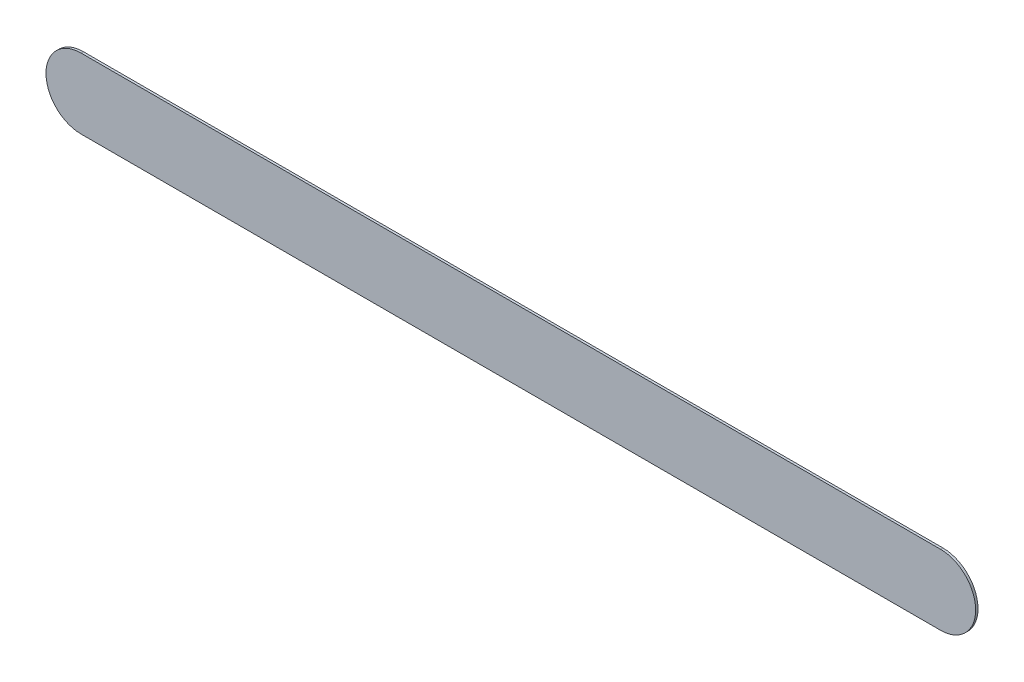
ISO-10303-21;
HEADER;
FILE_DESCRIPTION(('STEP AP214'),'2;1');
FILE_NAME('part.step','',(''),(''),'','','');
FILE_SCHEMA(('AUTOMOTIVE_DESIGN { 1 0 10303 214 1 1 1 1 }'));
ENDSEC;
DATA;
#1=APPLICATION_CONTEXT('core data for automotive mechanical design processes');
#2=APPLICATION_PROTOCOL_DEFINITION('international standard','automotive_design',2000,#1);
#3=PRODUCT_CONTEXT('',#1,'mechanical');
#4=PRODUCT('Part','Part','',(#3));
#5=PRODUCT_RELATED_PRODUCT_CATEGORY('part','',(#4));
#6=PRODUCT_DEFINITION_FORMATION('','',#4);
#7=PRODUCT_DEFINITION_CONTEXT('part definition',#1,'design');
#8=PRODUCT_DEFINITION('design','',#6,#7);
#9=PRODUCT_DEFINITION_SHAPE('','',#8);
#10=(LENGTH_UNIT() NAMED_UNIT(*) SI_UNIT(.MILLI.,.METRE.));
#11=(NAMED_UNIT(*) PLANE_ANGLE_UNIT() SI_UNIT($,.RADIAN.));
#12=(NAMED_UNIT(*) SI_UNIT($,.STERADIAN.) SOLID_ANGLE_UNIT());
#13=UNCERTAINTY_MEASURE_WITH_UNIT(LENGTH_MEASURE(1.E-05),#10,'distance_accuracy_value','');
#14=(GEOMETRIC_REPRESENTATION_CONTEXT(3) GLOBAL_UNCERTAINTY_ASSIGNED_CONTEXT((#13)) GLOBAL_UNIT_ASSIGNED_CONTEXT((#10,
#11,#12)) REPRESENTATION_CONTEXT('',''));
#15=CARTESIAN_POINT('',(0.,0.,0.));
#16=DIRECTION('',(0.,0.,1.));
#17=DIRECTION('',(1.,0.,0.));
#18=AXIS2_PLACEMENT_3D('',#15,#16,#17);
#19=CARTESIAN_POINT('',(-356.506,0.,3.));
#20=DIRECTION('',(0.,0.,-1.));
#21=DIRECTION('',(-1.,0.,0.));
#22=AXIS2_PLACEMENT_3D('',#19,#20,#21);
#23=CYLINDRICAL_SURFACE('',#22,44.9);
#24=CARTESIAN_POINT('',(-356.506,0.,0.));
#25=DIRECTION('',(0.,0.,1.));
#26=DIRECTION('',(1.,0.,0.));
#27=AXIS2_PLACEMENT_3D('',#24,#25,#26);
#28=CIRCLE('',#27,44.9);
#29=CARTESIAN_POINT('',(-356.506,44.9,0.));
#30=VERTEX_POINT('',#29);
#31=CARTESIAN_POINT('',(-356.506,-44.9,0.));
#32=VERTEX_POINT('',#31);
#33=EDGE_CURVE('E96',#30,#32,#28,.T.);
#34=ORIENTED_EDGE('',*,*,#33,.T.);
#35=DIRECTION('',(0.,0.,-1.));
#36=VECTOR('',#35,1.);
#37=CARTESIAN_POINT('',(-356.506,-44.9,3.));
#38=LINE('',#37,#36);
#39=CARTESIAN_POINT('',(-356.506,-44.9,3.));
#40=VERTEX_POINT('',#39);
#41=EDGE_CURVE('E11',#40,#32,#38,.T.);
#42=ORIENTED_EDGE('',*,*,#41,.F.);
#43=CARTESIAN_POINT('',(-356.506,0.,3.));
#44=DIRECTION('',(0.,0.,1.));
#45=DIRECTION('',(1.,0.,0.));
#46=AXIS2_PLACEMENT_3D('',#43,#44,#45);
#47=CIRCLE('',#46,44.9);
#48=CARTESIAN_POINT('',(-356.506,44.9,3.));
#49=VERTEX_POINT('',#48);
#50=EDGE_CURVE('E82',#49,#40,#47,.T.);
#51=ORIENTED_EDGE('',*,*,#50,.F.);
#52=DIRECTION('',(0.,0.,-1.));
#53=VECTOR('',#52,1.);
#54=CARTESIAN_POINT('',(-356.506,44.9,3.));
#55=LINE('',#54,#53);
#56=EDGE_CURVE('E49',#49,#30,#55,.T.);
#57=ORIENTED_EDGE('',*,*,#56,.T.);
#58=EDGE_LOOP('',(#34,#42,#51,#57));
#59=FACE_BOUND('',#58,.T.);
#60=ADVANCED_FACE('F33',(#59),#23,.T.);
#61=CARTESIAN_POINT('',(-356.506,-44.9,3.));
#62=DIRECTION('',(0.,1.,0.));
#63=DIRECTION('',(0.,0.,1.));
#64=AXIS2_PLACEMENT_3D('',#61,#62,#63);
#65=PLANE('',#64);
#66=DIRECTION('',(1.,0.,0.));
#67=VECTOR('',#66,1.);
#68=CARTESIAN_POINT('',(-356.506,-44.9,0.));
#69=LINE('',#68,#67);
#70=CARTESIAN_POINT('',(743.294,-44.9,0.));
#71=VERTEX_POINT('',#70);
#72=EDGE_CURVE('E87',#32,#71,#69,.T.);
#73=ORIENTED_EDGE('',*,*,#72,.T.);
#74=DIRECTION('',(0.,0.,-1.));
#75=VECTOR('',#74,1.);
#76=CARTESIAN_POINT('',(743.294,-44.9,3.));
#77=LINE('',#76,#75);
#78=CARTESIAN_POINT('',(743.294,-44.9,3.));
#79=VERTEX_POINT('',#78);
#80=EDGE_CURVE('E41',#79,#71,#77,.T.);
#81=ORIENTED_EDGE('',*,*,#80,.F.);
#82=DIRECTION('',(1.,0.,0.));
#83=VECTOR('',#82,1.);
#84=CARTESIAN_POINT('',(-356.506,-44.9,3.));
#85=LINE('',#84,#83);
#86=EDGE_CURVE('E75',#40,#79,#85,.T.);
#87=ORIENTED_EDGE('',*,*,#86,.F.);
#88=ORIENTED_EDGE('',*,*,#41,.T.);
#89=EDGE_LOOP('',(#73,#81,#87,#88));
#90=FACE_BOUND('',#89,.T.);
#91=ADVANCED_FACE('F86',(#90),#65,.F.);
#92=CARTESIAN_POINT('',(743.294,0.,3.));
#93=DIRECTION('',(0.,0.,-1.));
#94=DIRECTION('',(-1.,0.,0.));
#95=AXIS2_PLACEMENT_3D('',#92,#93,#94);
#96=CYLINDRICAL_SURFACE('',#95,44.9);
#97=CARTESIAN_POINT('',(743.294,0.,0.));
#98=DIRECTION('',(0.,0.,1.));
#99=DIRECTION('',(1.,0.,0.));
#100=AXIS2_PLACEMENT_3D('',#97,#98,#99);
#101=CIRCLE('',#100,44.9);
#102=CARTESIAN_POINT('',(743.294,44.9,0.));
#103=VERTEX_POINT('',#102);
#104=EDGE_CURVE('E99',#71,#103,#101,.T.);
#105=ORIENTED_EDGE('',*,*,#104,.T.);
#106=DIRECTION('',(0.,0.,-1.));
#107=VECTOR('',#106,1.);
#108=CARTESIAN_POINT('',(743.294,44.9,3.));
#109=LINE('',#108,#107);
#110=CARTESIAN_POINT('',(743.294,44.9,3.));
#111=VERTEX_POINT('',#110);
#112=EDGE_CURVE('E64',#111,#103,#109,.T.);
#113=ORIENTED_EDGE('',*,*,#112,.F.);
#114=CARTESIAN_POINT('',(743.294,0.,3.));
#115=DIRECTION('',(0.,0.,1.));
#116=DIRECTION('',(1.,0.,0.));
#117=AXIS2_PLACEMENT_3D('',#114,#115,#116);
#118=CIRCLE('',#117,44.9);
#119=EDGE_CURVE('E81',#79,#111,#118,.T.);
#120=ORIENTED_EDGE('',*,*,#119,.F.);
#121=ORIENTED_EDGE('',*,*,#80,.T.);
#122=EDGE_LOOP('',(#105,#113,#120,#121));
#123=FACE_BOUND('',#122,.T.);
#124=ADVANCED_FACE('F90',(#123),#96,.T.);
#125=CARTESIAN_POINT('',(-356.506,44.9,3.));
#126=DIRECTION('',(0.,1.,0.));
#127=DIRECTION('',(0.,0.,1.));
#128=AXIS2_PLACEMENT_3D('',#125,#126,#127);
#129=PLANE('',#128);
#130=DIRECTION('',(1.,0.,0.));
#131=VECTOR('',#130,1.);
#132=CARTESIAN_POINT('',(-356.506,44.9,0.));
#133=LINE('',#132,#131);
#134=EDGE_CURVE('E101',#30,#103,#133,.T.);
#135=ORIENTED_EDGE('',*,*,#134,.F.);
#136=ORIENTED_EDGE('',*,*,#56,.F.);
#137=DIRECTION('',(1.,0.,0.));
#138=VECTOR('',#137,1.);
#139=CARTESIAN_POINT('',(-356.506,44.9,3.));
#140=LINE('',#139,#138);
#141=EDGE_CURVE('E91',#49,#111,#140,.T.);
#142=ORIENTED_EDGE('',*,*,#141,.T.);
#143=ORIENTED_EDGE('',*,*,#112,.T.);
#144=EDGE_LOOP('',(#135,#136,#142,#143));
#145=FACE_BOUND('',#144,.T.);
#146=ADVANCED_FACE('F107',(#145),#129,.T.);
#147=CARTESIAN_POINT('',(-356.506,0.,3.));
#148=DIRECTION('',(0.,0.,1.));
#149=DIRECTION('',(1.,0.,0.));
#150=AXIS2_PLACEMENT_3D('',#147,#148,#149);
#151=PLANE('',#150);
#152=ORIENTED_EDGE('',*,*,#50,.T.);
#153=ORIENTED_EDGE('',*,*,#86,.T.);
#154=ORIENTED_EDGE('',*,*,#119,.T.);
#155=ORIENTED_EDGE('',*,*,#141,.F.);
#156=EDGE_LOOP('',(#152,#153,#154,#155));
#157=FACE_BOUND('',#156,.T.);
#158=ADVANCED_FACE('F78',(#157),#151,.T.);
#159=CARTESIAN_POINT('',(-356.506,0.,0.));
#160=DIRECTION('',(0.,0.,1.));
#161=DIRECTION('',(1.,0.,0.));
#162=AXIS2_PLACEMENT_3D('',#159,#160,#161);
#163=PLANE('',#162);
#164=ORIENTED_EDGE('',*,*,#33,.F.);
#165=ORIENTED_EDGE('',*,*,#134,.T.);
#166=ORIENTED_EDGE('',*,*,#104,.F.);
#167=ORIENTED_EDGE('',*,*,#72,.F.);
#168=EDGE_LOOP('',(#164,#165,#166,#167));
#169=FACE_BOUND('',#168,.T.);
#170=ADVANCED_FACE('F106',(#169),#163,.F.);
#171=CLOSED_SHELL('',(#60,#91,#124,#146,#158,#170));
#172=MANIFOLD_SOLID_BREP('B2',#171);
#173=ADVANCED_BREP_SHAPE_REPRESENTATION('',(#18,#172),#14);
#174=SHAPE_DEFINITION_REPRESENTATION(#9,#173);
ENDSEC;
END-ISO-10303-21;
